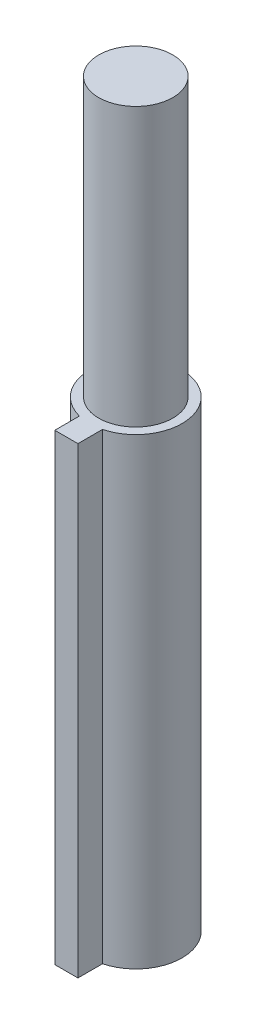
ISO-10303-21;
HEADER;
FILE_DESCRIPTION(('STEP AP214'),'2;1');
FILE_NAME('part.step','',(''),(''),'','','');
FILE_SCHEMA(('AUTOMOTIVE_DESIGN { 1 0 10303 214 1 1 1 1 }'));
ENDSEC;
DATA;
#1=APPLICATION_CONTEXT('core data for automotive mechanical design processes');
#2=APPLICATION_PROTOCOL_DEFINITION('international standard','automotive_design',2000,#1);
#3=PRODUCT_CONTEXT('',#1,'mechanical');
#4=PRODUCT('Part','Part','',(#3));
#5=PRODUCT_RELATED_PRODUCT_CATEGORY('part','',(#4));
#6=PRODUCT_DEFINITION_FORMATION('','',#4);
#7=PRODUCT_DEFINITION_CONTEXT('part definition',#1,'design');
#8=PRODUCT_DEFINITION('design','',#6,#7);
#9=PRODUCT_DEFINITION_SHAPE('','',#8);
#10=(LENGTH_UNIT() NAMED_UNIT(*) SI_UNIT(.MILLI.,.METRE.));
#11=(NAMED_UNIT(*) PLANE_ANGLE_UNIT() SI_UNIT($,.RADIAN.));
#12=(NAMED_UNIT(*) SI_UNIT($,.STERADIAN.) SOLID_ANGLE_UNIT());
#13=UNCERTAINTY_MEASURE_WITH_UNIT(LENGTH_MEASURE(1.E-05),#10,'distance_accuracy_value','');
#14=(GEOMETRIC_REPRESENTATION_CONTEXT(3) GLOBAL_UNCERTAINTY_ASSIGNED_CONTEXT((#13)) GLOBAL_UNIT_ASSIGNED_CONTEXT((#10,
#11,#12)) REPRESENTATION_CONTEXT('',''));
#15=CARTESIAN_POINT('',(0.,0.,0.));
#16=DIRECTION('',(0.,0.,1.));
#17=DIRECTION('',(1.,0.,0.));
#18=AXIS2_PLACEMENT_3D('',#15,#16,#17);
#19=CARTESIAN_POINT('',(0.,50.,0.));
#20=DIRECTION('',(0.,-1.,0.));
#21=DIRECTION('',(0.,0.,-1.));
#22=AXIS2_PLACEMENT_3D('',#19,#20,#21);
#23=CYLINDRICAL_SURFACE('',#22,5.);
#24=CARTESIAN_POINT('',(0.,50.,0.));
#25=DIRECTION('',(0.,1.,0.));
#26=DIRECTION('',(0.,0.,1.));
#27=AXIS2_PLACEMENT_3D('',#24,#25,#26);
#28=CIRCLE('',#27,5.);
#29=CARTESIAN_POINT('',(1.25,50.,4.84122918275927));
#30=VERTEX_POINT('',#29);
#31=CARTESIAN_POINT('',(-1.25,50.,4.84122918275927));
#32=VERTEX_POINT('',#31);
#33=EDGE_CURVE('E40',#30,#32,#28,.T.);
#34=ORIENTED_EDGE('',*,*,#33,.F.);
#35=DIRECTION('',(0.,-1.,0.));
#36=VECTOR('',#35,1.);
#37=CARTESIAN_POINT('',(1.25,50.,4.84122918275927));
#38=LINE('',#37,#36);
#39=CARTESIAN_POINT('',(1.25,0.,4.84122918275927));
#40=VERTEX_POINT('',#39);
#41=EDGE_CURVE('E102',#30,#40,#38,.T.);
#42=ORIENTED_EDGE('',*,*,#41,.T.);
#43=CARTESIAN_POINT('',(0.,0.,0.));
#44=DIRECTION('',(0.,1.,0.));
#45=DIRECTION('',(0.,0.,1.));
#46=AXIS2_PLACEMENT_3D('',#43,#44,#45);
#47=CIRCLE('',#46,5.);
#48=CARTESIAN_POINT('',(-1.25,0.,4.84122918275927));
#49=VERTEX_POINT('',#48);
#50=EDGE_CURVE('E35',#40,#49,#47,.T.);
#51=ORIENTED_EDGE('',*,*,#50,.T.);
#52=DIRECTION('',(0.,-1.,0.));
#53=VECTOR('',#52,1.);
#54=CARTESIAN_POINT('',(-1.25,50.,4.84122918275927));
#55=LINE('',#54,#53);
#56=EDGE_CURVE('E86',#49,#32,#55,.F.);
#57=ORIENTED_EDGE('',*,*,#56,.T.);
#58=EDGE_LOOP('',(#34,#42,#51,#57));
#59=FACE_BOUND('',#58,.T.);
#60=ADVANCED_FACE('F32',(#59),#23,.T.);
#61=CARTESIAN_POINT('',(0.,50.,0.));
#62=DIRECTION('',(0.,1.,0.));
#63=DIRECTION('',(0.,0.,1.));
#64=AXIS2_PLACEMENT_3D('',#61,#62,#63);
#65=PLANE('',#64);
#66=CARTESIAN_POINT('',(0.,50.,0.));
#67=DIRECTION('',(0.,1.,0.));
#68=DIRECTION('',(0.,0.,1.));
#69=AXIS2_PLACEMENT_3D('',#66,#67,#68);
#70=CIRCLE('',#69,4.);
#71=CARTESIAN_POINT('',(0.,50.,4.));
#72=VERTEX_POINT('',#71);
#73=EDGE_CURVE('E11',#72,#72,#70,.T.);
#74=ORIENTED_EDGE('',*,*,#73,.F.);
#75=EDGE_LOOP('',(#74));
#76=FACE_BOUND('',#75,.T.);
#77=ORIENTED_EDGE('',*,*,#33,.T.);
#78=DIRECTION('',(0.,0.,-1.));
#79=VECTOR('',#78,1.);
#80=CARTESIAN_POINT('',(-1.25,50.,7.5));
#81=LINE('',#80,#79);
#82=CARTESIAN_POINT('',(-1.25,50.,7.5));
#83=VERTEX_POINT('',#82);
#84=EDGE_CURVE('E48',#83,#32,#81,.T.);
#85=ORIENTED_EDGE('',*,*,#84,.F.);
#86=DIRECTION('',(-1.,0.,0.));
#87=VECTOR('',#86,1.);
#88=CARTESIAN_POINT('',(1.25,50.,7.5));
#89=LINE('',#88,#87);
#90=CARTESIAN_POINT('',(1.25,50.,7.5));
#91=VERTEX_POINT('',#90);
#92=EDGE_CURVE('E81',#91,#83,#89,.T.);
#93=ORIENTED_EDGE('',*,*,#92,.F.);
#94=DIRECTION('',(0.,0.,1.));
#95=VECTOR('',#94,1.);
#96=CARTESIAN_POINT('',(1.25,50.,7.5));
#97=LINE('',#96,#95);
#98=EDGE_CURVE('E92',#30,#91,#97,.T.);
#99=ORIENTED_EDGE('',*,*,#98,.F.);
#100=EDGE_LOOP('',(#77,#85,#93,#99));
#101=FACE_BOUND('',#100,.T.);
#102=ADVANCED_FACE('F112',(#76,#101),#65,.T.);
#103=CARTESIAN_POINT('',(0.,0.,0.));
#104=DIRECTION('',(0.,1.,0.));
#105=DIRECTION('',(0.,0.,1.));
#106=AXIS2_PLACEMENT_3D('',#103,#104,#105);
#107=PLANE('',#106);
#108=ORIENTED_EDGE('',*,*,#50,.F.);
#109=DIRECTION('',(0.,0.,1.));
#110=VECTOR('',#109,1.);
#111=CARTESIAN_POINT('',(1.25,0.,7.5));
#112=LINE('',#111,#110);
#113=CARTESIAN_POINT('',(1.25,0.,7.5));
#114=VERTEX_POINT('',#113);
#115=EDGE_CURVE('E56',#40,#114,#112,.T.);
#116=ORIENTED_EDGE('',*,*,#115,.T.);
#117=DIRECTION('',(-1.,0.,0.));
#118=VECTOR('',#117,1.);
#119=CARTESIAN_POINT('',(1.25,0.,7.5));
#120=LINE('',#119,#118);
#121=CARTESIAN_POINT('',(-1.25,0.,7.5));
#122=VERTEX_POINT('',#121);
#123=EDGE_CURVE('E79',#114,#122,#120,.T.);
#124=ORIENTED_EDGE('',*,*,#123,.T.);
#125=DIRECTION('',(0.,0.,-1.));
#126=VECTOR('',#125,1.);
#127=CARTESIAN_POINT('',(-1.25,0.,7.5));
#128=LINE('',#127,#126);
#129=EDGE_CURVE('E84',#122,#49,#128,.T.);
#130=ORIENTED_EDGE('',*,*,#129,.T.);
#131=EDGE_LOOP('',(#108,#116,#124,#130));
#132=FACE_BOUND('',#131,.T.);
#133=ADVANCED_FACE('F91',(#132),#107,.F.);
#134=CARTESIAN_POINT('',(0.,80.,0.));
#135=DIRECTION('',(0.,-1.,0.));
#136=DIRECTION('',(0.,0.,-1.));
#137=AXIS2_PLACEMENT_3D('',#134,#135,#136);
#138=CYLINDRICAL_SURFACE('',#137,4.);
#139=CARTESIAN_POINT('',(0.,80.,0.));
#140=DIRECTION('',(0.,1.,0.));
#141=DIRECTION('',(0.,0.,1.));
#142=AXIS2_PLACEMENT_3D('',#139,#140,#141);
#143=CIRCLE('',#142,4.);
#144=CARTESIAN_POINT('',(0.,80.,4.));
#145=VERTEX_POINT('',#144);
#146=EDGE_CURVE('E104',#145,#145,#143,.T.);
#147=ORIENTED_EDGE('',*,*,#146,.F.);
#148=EDGE_LOOP('',(#147));
#149=FACE_BOUND('',#148,.T.);
#150=ORIENTED_EDGE('',*,*,#73,.T.);
#151=EDGE_LOOP('',(#150));
#152=FACE_BOUND('',#151,.T.);
#153=ADVANCED_FACE('F120',(#149,#152),#138,.T.);
#154=CARTESIAN_POINT('',(0.,80.,0.));
#155=DIRECTION('',(0.,1.,0.));
#156=DIRECTION('',(0.,0.,1.));
#157=AXIS2_PLACEMENT_3D('',#154,#155,#156);
#158=PLANE('',#157);
#159=ORIENTED_EDGE('',*,*,#146,.T.);
#160=EDGE_LOOP('',(#159));
#161=FACE_BOUND('',#160,.T.);
#162=ADVANCED_FACE('F125',(#161),#158,.T.);
#163=CARTESIAN_POINT('',(1.25,55.5901699437495,7.5));
#164=DIRECTION('',(1.,0.,0.));
#165=DIRECTION('',(0.,0.,-1.));
#166=AXIS2_PLACEMENT_3D('',#163,#164,#165);
#167=PLANE('',#166);
#168=ORIENTED_EDGE('',*,*,#41,.F.);
#169=ORIENTED_EDGE('',*,*,#98,.T.);
#170=DIRECTION('',(0.,-1.,0.));
#171=VECTOR('',#170,1.);
#172=CARTESIAN_POINT('',(1.25,55.5901699437495,7.5));
#173=LINE('',#172,#171);
#174=EDGE_CURVE('E94',#91,#114,#173,.T.);
#175=ORIENTED_EDGE('',*,*,#174,.T.);
#176=ORIENTED_EDGE('',*,*,#115,.F.);
#177=EDGE_LOOP('',(#168,#169,#175,#176));
#178=FACE_BOUND('',#177,.T.);
#179=ADVANCED_FACE('F111',(#178),#167,.T.);
#180=CARTESIAN_POINT('',(-1.25,55.5901699437495,7.5));
#181=DIRECTION('',(-1.,0.,0.));
#182=DIRECTION('',(0.,0.,1.));
#183=AXIS2_PLACEMENT_3D('',#180,#181,#182);
#184=PLANE('',#183);
#185=ORIENTED_EDGE('',*,*,#56,.F.);
#186=ORIENTED_EDGE('',*,*,#129,.F.);
#187=DIRECTION('',(0.,-1.,0.));
#188=VECTOR('',#187,1.);
#189=CARTESIAN_POINT('',(-1.25,55.5901699437495,7.5));
#190=LINE('',#189,#188);
#191=EDGE_CURVE('E74',#83,#122,#190,.T.);
#192=ORIENTED_EDGE('',*,*,#191,.F.);
#193=ORIENTED_EDGE('',*,*,#84,.T.);
#194=EDGE_LOOP('',(#185,#186,#192,#193));
#195=FACE_BOUND('',#194,.T.);
#196=ADVANCED_FACE('F85',(#195),#184,.T.);
#197=CARTESIAN_POINT('',(1.25,55.5901699437495,7.5));
#198=DIRECTION('',(0.,0.,1.));
#199=DIRECTION('',(1.,0.,0.));
#200=AXIS2_PLACEMENT_3D('',#197,#198,#199);
#201=PLANE('',#200);
#202=ORIENTED_EDGE('',*,*,#174,.F.);
#203=ORIENTED_EDGE('',*,*,#92,.T.);
#204=ORIENTED_EDGE('',*,*,#191,.T.);
#205=ORIENTED_EDGE('',*,*,#123,.F.);
#206=EDGE_LOOP('',(#202,#203,#204,#205));
#207=FACE_BOUND('',#206,.T.);
#208=ADVANCED_FACE('F77',(#207),#201,.T.);
#209=CLOSED_SHELL('',(#60,#102,#133,#153,#162,#179,#196,#208));
#210=MANIFOLD_SOLID_BREP('B2',#209);
#211=ADVANCED_BREP_SHAPE_REPRESENTATION('',(#18,#210),#14);
#212=SHAPE_DEFINITION_REPRESENTATION(#9,#211);
ENDSEC;
END-ISO-10303-21;
